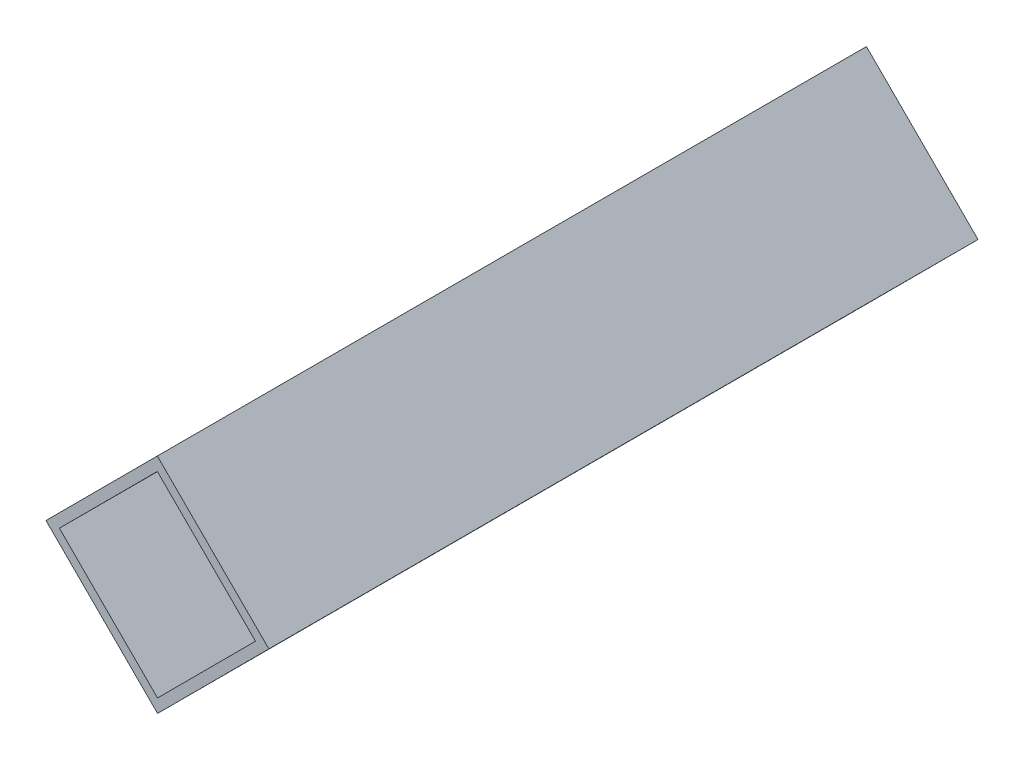
ISO-10303-21;
HEADER;
FILE_DESCRIPTION(('STEP AP214'),'2;1');
FILE_NAME('part.step','',(''),(''),'','','');
FILE_SCHEMA(('AUTOMOTIVE_DESIGN { 1 0 10303 214 1 1 1 1 }'));
ENDSEC;
DATA;
#1=APPLICATION_CONTEXT('core data for automotive mechanical design processes');
#2=APPLICATION_PROTOCOL_DEFINITION('international standard','automotive_design',2000,#1);
#3=PRODUCT_CONTEXT('',#1,'mechanical');
#4=PRODUCT('Part','Part','',(#3));
#5=PRODUCT_RELATED_PRODUCT_CATEGORY('part','',(#4));
#6=PRODUCT_DEFINITION_FORMATION('','',#4);
#7=PRODUCT_DEFINITION_CONTEXT('part definition',#1,'design');
#8=PRODUCT_DEFINITION('design','',#6,#7);
#9=PRODUCT_DEFINITION_SHAPE('','',#8);
#10=(LENGTH_UNIT() NAMED_UNIT(*) SI_UNIT(.MILLI.,.METRE.));
#11=(NAMED_UNIT(*) PLANE_ANGLE_UNIT() SI_UNIT($,.RADIAN.));
#12=(NAMED_UNIT(*) SI_UNIT($,.STERADIAN.) SOLID_ANGLE_UNIT());
#13=UNCERTAINTY_MEASURE_WITH_UNIT(LENGTH_MEASURE(1.E-05),#10,'distance_accuracy_value','');
#14=(GEOMETRIC_REPRESENTATION_CONTEXT(3) GLOBAL_UNCERTAINTY_ASSIGNED_CONTEXT((#13)) GLOBAL_UNIT_ASSIGNED_CONTEXT((#10,
#11,#12)) REPRESENTATION_CONTEXT('',''));
#15=CARTESIAN_POINT('',(0.,0.,0.));
#16=DIRECTION('',(0.,0.,1.));
#17=DIRECTION('',(1.,0.,0.));
#18=AXIS2_PLACEMENT_3D('',#15,#16,#17);
#19=CARTESIAN_POINT('',(0.,0.,112.5));
#20=DIRECTION('',(0.,0.,1.));
#21=DIRECTION('',(1.,0.,0.));
#22=AXIS2_PLACEMENT_3D('',#19,#20,#21);
#23=PLANE('',#22);
#24=DIRECTION('',(-0.70646122875546,-0.707751744798503,0.));
#25=VECTOR('',#24,1.);
#26=CARTESIAN_POINT('',(0.,0.,112.5));
#27=LINE('',#26,#25);
#28=CARTESIAN_POINT('',(0.,0.,112.5));
#29=VERTEX_POINT('',#28);
#30=CARTESIAN_POINT('',(-17.6615307188865,-17.6937936199626,112.5));
#31=VERTEX_POINT('',#30);
#32=EDGE_CURVE('E153',#29,#31,#27,.T.);
#33=ORIENTED_EDGE('',*,*,#32,.T.);
#34=DIRECTION('',(0.707751744798503,-0.70646122875546,0.));
#35=VECTOR('',#34,1.);
#36=CARTESIAN_POINT('',(-17.6615307188865,-17.6937936199626,112.5));
#37=LINE('',#36,#35);
#38=CARTESIAN_POINT('',(0.0322629010760627,-35.3553243388491,112.5));
#39=VERTEX_POINT('',#38);
#40=EDGE_CURVE('E157',#31,#39,#37,.T.);
#41=ORIENTED_EDGE('',*,*,#40,.T.);
#42=DIRECTION('',(0.70646122875546,0.707751744798503,0.));
#43=VECTOR('',#42,1.);
#44=CARTESIAN_POINT('',(17.6937936199626,-17.6615307188865,112.5));
#45=LINE('',#44,#43);
#46=CARTESIAN_POINT('',(17.6937936199626,-17.6615307188865,112.5));
#47=VERTEX_POINT('',#46);
#48=EDGE_CURVE('E161',#39,#47,#45,.T.);
#49=ORIENTED_EDGE('',*,*,#48,.T.);
#50=DIRECTION('',(-0.707751744798503,0.70646122875546,0.));
#51=VECTOR('',#50,1.);
#52=CARTESIAN_POINT('',(0.,0.,112.5));
#53=LINE('',#52,#51);
#54=EDGE_CURVE('E164',#47,#29,#53,.T.);
#55=ORIENTED_EDGE('',*,*,#54,.T.);
#56=EDGE_LOOP('',(#33,#41,#49,#55));
#57=FACE_BOUND('',#56,.T.);
#58=DIRECTION('',(-0.706461228755461,-0.707751744798503,0.));
#59=VECTOR('',#58,1.);
#60=CARTESIAN_POINT('',(0.00193577406456353,-2.12131946033095,112.5));
#61=LINE('',#60,#59);
#62=CARTESIAN_POINT('',(0.00193577406456353,-2.12131946033095,112.5));
#63=VERTEX_POINT('',#62);
#64=CARTESIAN_POINT('',(-15.5402112585556,-17.691857845898,112.5));
#65=VERTEX_POINT('',#64);
#66=EDGE_CURVE('E114',#63,#65,#61,.T.);
#67=ORIENTED_EDGE('',*,*,#66,.F.);
#68=DIRECTION('',(-0.707751744798503,0.70646122875546,0.));
#69=VECTOR('',#68,1.);
#70=CARTESIAN_POINT('',(0.00193577406456353,-2.12131946033095,112.5));
#71=LINE('',#70,#69);
#72=CARTESIAN_POINT('',(15.5724741596316,-17.6634664929511,112.5));
#73=VERTEX_POINT('',#72);
#74=EDGE_CURVE('E105',#73,#63,#71,.T.);
#75=ORIENTED_EDGE('',*,*,#74,.F.);
#76=DIRECTION('',(0.70646122875546,0.707751744798503,0.));
#77=VECTOR('',#76,1.);
#78=CARTESIAN_POINT('',(15.5724741596316,-17.6634664929511,112.5));
#79=LINE('',#78,#77);
#80=CARTESIAN_POINT('',(0.0303271270114952,-33.2340048785181,112.5));
#81=VERTEX_POINT('',#80);
#82=EDGE_CURVE('E131',#81,#73,#79,.T.);
#83=ORIENTED_EDGE('',*,*,#82,.F.);
#84=DIRECTION('',(0.707751744798503,-0.70646122875546,0.));
#85=VECTOR('',#84,1.);
#86=CARTESIAN_POINT('',(-15.5402112585556,-17.691857845898,112.5));
#87=LINE('',#86,#85);
#88=EDGE_CURVE('E127',#65,#81,#87,.T.);
#89=ORIENTED_EDGE('',*,*,#88,.F.);
#90=EDGE_LOOP('',(#67,#75,#83,#89));
#91=FACE_BOUND('',#90,.T.);
#92=ADVANCED_FACE('F39',(#57,#91),#23,.T.);
#93=CARTESIAN_POINT('',(0.,0.,0.));
#94=DIRECTION('',(0.,0.,1.));
#95=DIRECTION('',(1.,0.,0.));
#96=AXIS2_PLACEMENT_3D('',#93,#94,#95);
#97=PLANE('',#96);
#98=DIRECTION('',(-0.70646122875546,-0.707751744798503,0.));
#99=VECTOR('',#98,1.);
#100=CARTESIAN_POINT('',(0.,0.,0.));
#101=LINE('',#100,#99);
#102=CARTESIAN_POINT('',(0.,0.,0.));
#103=VERTEX_POINT('',#102);
#104=CARTESIAN_POINT('',(-17.6615307188865,-17.6937936199626,0.));
#105=VERTEX_POINT('',#104);
#106=EDGE_CURVE('E123',#103,#105,#101,.T.);
#107=ORIENTED_EDGE('',*,*,#106,.F.);
#108=DIRECTION('',(-0.707751744798503,0.70646122875546,0.));
#109=VECTOR('',#108,1.);
#110=CARTESIAN_POINT('',(0.,0.,0.));
#111=LINE('',#110,#109);
#112=CARTESIAN_POINT('',(17.6937936199626,-17.6615307188865,0.));
#113=VERTEX_POINT('',#112);
#114=EDGE_CURVE('E158',#113,#103,#111,.T.);
#115=ORIENTED_EDGE('',*,*,#114,.F.);
#116=DIRECTION('',(0.70646122875546,0.707751744798503,0.));
#117=VECTOR('',#116,1.);
#118=CARTESIAN_POINT('',(17.6937936199626,-17.6615307188865,0.));
#119=LINE('',#118,#117);
#120=CARTESIAN_POINT('',(0.0322629010760627,-35.3553243388491,0.));
#121=VERTEX_POINT('',#120);
#122=EDGE_CURVE('E174',#121,#113,#119,.T.);
#123=ORIENTED_EDGE('',*,*,#122,.F.);
#124=DIRECTION('',(0.707751744798503,-0.70646122875546,0.));
#125=VECTOR('',#124,1.);
#126=CARTESIAN_POINT('',(-17.6615307188865,-17.6937936199626,0.));
#127=LINE('',#126,#125);
#128=EDGE_CURVE('E171',#105,#121,#127,.T.);
#129=ORIENTED_EDGE('',*,*,#128,.F.);
#130=EDGE_LOOP('',(#107,#115,#123,#129));
#131=FACE_BOUND('',#130,.T.);
#132=DIRECTION('',(-0.707751744798503,0.70646122875546,0.));
#133=VECTOR('',#132,1.);
#134=CARTESIAN_POINT('',(0.00193577406456353,-2.12131946033095,0.));
#135=LINE('',#134,#133);
#136=CARTESIAN_POINT('',(15.5724741596316,-17.6634664929511,0.));
#137=VERTEX_POINT('',#136);
#138=CARTESIAN_POINT('',(0.00193577406456353,-2.12131946033095,0.));
#139=VERTEX_POINT('',#138);
#140=EDGE_CURVE('E63',#137,#139,#135,.T.);
#141=ORIENTED_EDGE('',*,*,#140,.T.);
#142=DIRECTION('',(-0.706461228755461,-0.707751744798503,0.));
#143=VECTOR('',#142,1.);
#144=CARTESIAN_POINT('',(0.00193577406456353,-2.12131946033095,0.));
#145=LINE('',#144,#143);
#146=CARTESIAN_POINT('',(-15.5402112585556,-17.691857845898,0.));
#147=VERTEX_POINT('',#146);
#148=EDGE_CURVE('E121',#139,#147,#145,.T.);
#149=ORIENTED_EDGE('',*,*,#148,.T.);
#150=DIRECTION('',(0.707751744798503,-0.70646122875546,0.));
#151=VECTOR('',#150,1.);
#152=CARTESIAN_POINT('',(-15.5402112585556,-17.691857845898,0.));
#153=LINE('',#152,#151);
#154=CARTESIAN_POINT('',(0.0303271270114987,-33.2340048785181,0.));
#155=VERTEX_POINT('',#154);
#156=EDGE_CURVE('E140',#147,#155,#153,.T.);
#157=ORIENTED_EDGE('',*,*,#156,.T.);
#158=DIRECTION('',(0.70646122875546,0.707751744798503,0.));
#159=VECTOR('',#158,1.);
#160=CARTESIAN_POINT('',(15.5724741596316,-17.6634664929511,0.));
#161=LINE('',#160,#159);
#162=EDGE_CURVE('E115',#155,#137,#161,.T.);
#163=ORIENTED_EDGE('',*,*,#162,.T.);
#164=EDGE_LOOP('',(#141,#149,#157,#163));
#165=FACE_BOUND('',#164,.T.);
#166=ADVANCED_FACE('F197',(#131,#165),#97,.F.);
#167=CARTESIAN_POINT('',(0.,0.,112.5));
#168=DIRECTION('',(0.707751744798503,-0.70646122875546,0.));
#169=DIRECTION('',(0.70646122875546,0.707751744798503,0.));
#170=AXIS2_PLACEMENT_3D('',#167,#168,#169);
#171=PLANE('',#170);
#172=ORIENTED_EDGE('',*,*,#106,.T.);
#173=DIRECTION('',(0.,0.,-1.));
#174=VECTOR('',#173,1.);
#175=CARTESIAN_POINT('',(-17.6615307188865,-17.6937936199626,112.5));
#176=LINE('',#175,#174);
#177=EDGE_CURVE('E11',#31,#105,#176,.T.);
#178=ORIENTED_EDGE('',*,*,#177,.F.);
#179=ORIENTED_EDGE('',*,*,#32,.F.);
#180=DIRECTION('',(0.,0.,-1.));
#181=VECTOR('',#180,1.);
#182=CARTESIAN_POINT('',(0.,0.,112.5));
#183=LINE('',#182,#181);
#184=EDGE_CURVE('E167',#29,#103,#183,.T.);
#185=ORIENTED_EDGE('',*,*,#184,.T.);
#186=EDGE_LOOP('',(#172,#178,#179,#185));
#187=FACE_BOUND('',#186,.T.);
#188=ADVANCED_FACE('F41',(#187),#171,.F.);
#189=CARTESIAN_POINT('',(-17.6615307188865,-17.6937936199626,112.5));
#190=DIRECTION('',(0.70646122875546,0.707751744798503,0.));
#191=DIRECTION('',(-0.707751744798503,0.70646122875546,0.));
#192=AXIS2_PLACEMENT_3D('',#189,#190,#191);
#193=PLANE('',#192);
#194=ORIENTED_EDGE('',*,*,#128,.T.);
#195=DIRECTION('',(0.,0.,-1.));
#196=VECTOR('',#195,1.);
#197=CARTESIAN_POINT('',(0.0322629010760627,-35.3553243388491,112.5));
#198=LINE('',#197,#196);
#199=EDGE_CURVE('E48',#39,#121,#198,.T.);
#200=ORIENTED_EDGE('',*,*,#199,.F.);
#201=ORIENTED_EDGE('',*,*,#40,.F.);
#202=ORIENTED_EDGE('',*,*,#177,.T.);
#203=EDGE_LOOP('',(#194,#200,#201,#202));
#204=FACE_BOUND('',#203,.T.);
#205=ADVANCED_FACE('F207',(#204),#193,.F.);
#206=CARTESIAN_POINT('',(17.6937936199626,-17.6615307188865,112.5));
#207=DIRECTION('',(-0.707751744798503,0.70646122875546,0.));
#208=DIRECTION('',(-0.70646122875546,-0.707751744798503,0.));
#209=AXIS2_PLACEMENT_3D('',#206,#207,#208);
#210=PLANE('',#209);
#211=ORIENTED_EDGE('',*,*,#122,.T.);
#212=DIRECTION('',(0.,0.,-1.));
#213=VECTOR('',#212,1.);
#214=CARTESIAN_POINT('',(17.6937936199626,-17.6615307188865,112.5));
#215=LINE('',#214,#213);
#216=EDGE_CURVE('E182',#47,#113,#215,.T.);
#217=ORIENTED_EDGE('',*,*,#216,.F.);
#218=ORIENTED_EDGE('',*,*,#48,.F.);
#219=ORIENTED_EDGE('',*,*,#199,.T.);
#220=EDGE_LOOP('',(#211,#217,#218,#219));
#221=FACE_BOUND('',#220,.T.);
#222=ADVANCED_FACE('F191',(#221),#210,.F.);
#223=CARTESIAN_POINT('',(0.,0.,112.5));
#224=DIRECTION('',(-0.70646122875546,-0.707751744798503,0.));
#225=DIRECTION('',(0.707751744798503,-0.70646122875546,0.));
#226=AXIS2_PLACEMENT_3D('',#223,#224,#225);
#227=PLANE('',#226);
#228=ORIENTED_EDGE('',*,*,#114,.T.);
#229=ORIENTED_EDGE('',*,*,#184,.F.);
#230=ORIENTED_EDGE('',*,*,#54,.F.);
#231=ORIENTED_EDGE('',*,*,#216,.T.);
#232=EDGE_LOOP('',(#228,#229,#230,#231));
#233=FACE_BOUND('',#232,.T.);
#234=ADVANCED_FACE('F201',(#233),#227,.F.);
#235=CARTESIAN_POINT('',(0.00193577406456353,-2.12131946033095,112.5));
#236=DIRECTION('',(-0.70646122875546,-0.707751744798503,0.));
#237=DIRECTION('',(0.707751744798503,-0.70646122875546,0.));
#238=AXIS2_PLACEMENT_3D('',#235,#236,#237);
#239=PLANE('',#238);
#240=ORIENTED_EDGE('',*,*,#140,.F.);
#241=DIRECTION('',(0.,0.,-1.));
#242=VECTOR('',#241,1.);
#243=CARTESIAN_POINT('',(15.5724741596316,-17.6634664929511,112.5));
#244=LINE('',#243,#242);
#245=EDGE_CURVE('E109',#73,#137,#244,.T.);
#246=ORIENTED_EDGE('',*,*,#245,.F.);
#247=ORIENTED_EDGE('',*,*,#74,.T.);
#248=DIRECTION('',(0.,0.,-1.));
#249=VECTOR('',#248,1.);
#250=CARTESIAN_POINT('',(0.00193577406456353,-2.12131946033095,112.5));
#251=LINE('',#250,#249);
#252=EDGE_CURVE('E108',#63,#139,#251,.T.);
#253=ORIENTED_EDGE('',*,*,#252,.T.);
#254=EDGE_LOOP('',(#240,#246,#247,#253));
#255=FACE_BOUND('',#254,.T.);
#256=ADVANCED_FACE('F107',(#255),#239,.T.);
#257=CARTESIAN_POINT('',(0.00193577406456353,-2.12131946033095,112.5));
#258=DIRECTION('',(0.707751744798503,-0.706461228755461,0.));
#259=DIRECTION('',(0.706461228755461,0.707751744798503,0.));
#260=AXIS2_PLACEMENT_3D('',#257,#258,#259);
#261=PLANE('',#260);
#262=ORIENTED_EDGE('',*,*,#148,.F.);
#263=ORIENTED_EDGE('',*,*,#252,.F.);
#264=ORIENTED_EDGE('',*,*,#66,.T.);
#265=DIRECTION('',(0.,0.,-1.));
#266=VECTOR('',#265,1.);
#267=CARTESIAN_POINT('',(-15.5402112585556,-17.691857845898,112.5));
#268=LINE('',#267,#266);
#269=EDGE_CURVE('E124',#65,#147,#268,.T.);
#270=ORIENTED_EDGE('',*,*,#269,.T.);
#271=EDGE_LOOP('',(#262,#263,#264,#270));
#272=FACE_BOUND('',#271,.T.);
#273=ADVANCED_FACE('F118',(#272),#261,.T.);
#274=CARTESIAN_POINT('',(-15.5402112585556,-17.691857845898,112.5));
#275=DIRECTION('',(0.70646122875546,0.707751744798503,0.));
#276=DIRECTION('',(-0.707751744798503,0.70646122875546,0.));
#277=AXIS2_PLACEMENT_3D('',#274,#275,#276);
#278=PLANE('',#277);
#279=ORIENTED_EDGE('',*,*,#156,.F.);
#280=ORIENTED_EDGE('',*,*,#269,.F.);
#281=ORIENTED_EDGE('',*,*,#88,.T.);
#282=DIRECTION('',(0.,0.,-1.));
#283=VECTOR('',#282,1.);
#284=CARTESIAN_POINT('',(0.0303271270114987,-33.2340048785181,112.5));
#285=LINE('',#284,#283);
#286=EDGE_CURVE('E55',#81,#155,#285,.T.);
#287=ORIENTED_EDGE('',*,*,#286,.T.);
#288=EDGE_LOOP('',(#279,#280,#281,#287));
#289=FACE_BOUND('',#288,.T.);
#290=ADVANCED_FACE('F230',(#289),#278,.T.);
#291=CARTESIAN_POINT('',(15.5724741596316,-17.6634664929511,112.5));
#292=DIRECTION('',(-0.707751744798503,0.70646122875546,0.));
#293=DIRECTION('',(-0.70646122875546,-0.707751744798503,0.));
#294=AXIS2_PLACEMENT_3D('',#291,#292,#293);
#295=PLANE('',#294);
#296=ORIENTED_EDGE('',*,*,#162,.F.);
#297=ORIENTED_EDGE('',*,*,#286,.F.);
#298=ORIENTED_EDGE('',*,*,#82,.T.);
#299=ORIENTED_EDGE('',*,*,#245,.T.);
#300=EDGE_LOOP('',(#296,#297,#298,#299));
#301=FACE_BOUND('',#300,.T.);
#302=ADVANCED_FACE('F234',(#301),#295,.T.);
#303=CLOSED_SHELL('',(#92,#166,#188,#205,#222,#234,#256,#273,#290,#302));
#304=MANIFOLD_SOLID_BREP('B2',#303);
#305=ADVANCED_BREP_SHAPE_REPRESENTATION('',(#18,#304),#14);
#306=SHAPE_DEFINITION_REPRESENTATION(#9,#305);
ENDSEC;
END-ISO-10303-21;
